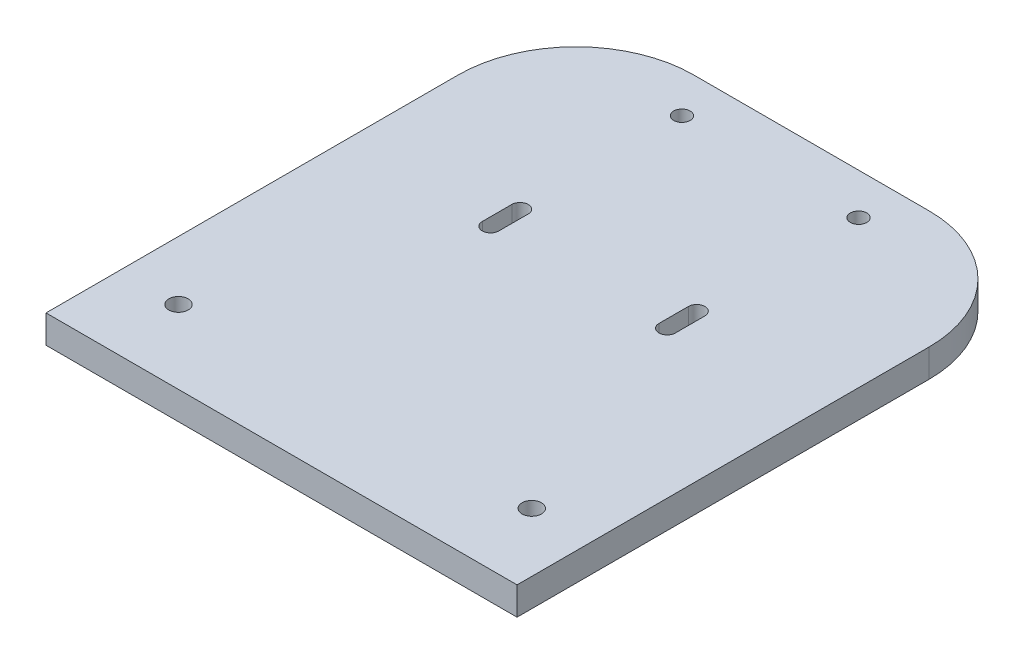
ISO-10303-21;
HEADER;
FILE_DESCRIPTION(('STEP AP214'),'2;1');
FILE_NAME('part.step','',(''),(''),'','','');
FILE_SCHEMA(('AUTOMOTIVE_DESIGN { 1 0 10303 214 1 1 1 1 }'));
ENDSEC;
DATA;
#1=APPLICATION_CONTEXT('core data for automotive mechanical design processes');
#2=APPLICATION_PROTOCOL_DEFINITION('international standard','automotive_design',2000,#1);
#3=PRODUCT_CONTEXT('',#1,'mechanical');
#4=PRODUCT('Part','Part','',(#3));
#5=PRODUCT_RELATED_PRODUCT_CATEGORY('part','',(#4));
#6=PRODUCT_DEFINITION_FORMATION('','',#4);
#7=PRODUCT_DEFINITION_CONTEXT('part definition',#1,'design');
#8=PRODUCT_DEFINITION('design','',#6,#7);
#9=PRODUCT_DEFINITION_SHAPE('','',#8);
#10=(LENGTH_UNIT() NAMED_UNIT(*) SI_UNIT(.MILLI.,.METRE.));
#11=(NAMED_UNIT(*) PLANE_ANGLE_UNIT() SI_UNIT($,.RADIAN.));
#12=(NAMED_UNIT(*) SI_UNIT($,.STERADIAN.) SOLID_ANGLE_UNIT());
#13=UNCERTAINTY_MEASURE_WITH_UNIT(LENGTH_MEASURE(1.E-05),#10,'distance_accuracy_value','');
#14=(GEOMETRIC_REPRESENTATION_CONTEXT(3) GLOBAL_UNCERTAINTY_ASSIGNED_CONTEXT((#13)) GLOBAL_UNIT_ASSIGNED_CONTEXT((#10,
#11,#12)) REPRESENTATION_CONTEXT('',''));
#15=CARTESIAN_POINT('',(0.,0.,0.));
#16=DIRECTION('',(0.,0.,1.));
#17=DIRECTION('',(1.,0.,0.));
#18=AXIS2_PLACEMENT_3D('',#15,#16,#17);
#19=CARTESIAN_POINT('',(0.,4.76,0.));
#20=DIRECTION('',(1.,0.,0.));
#21=DIRECTION('',(0.,0.,-1.));
#22=AXIS2_PLACEMENT_3D('',#19,#20,#21);
#23=PLANE('',#22);
#24=DIRECTION('',(0.,0.,1.));
#25=VECTOR('',#24,1.);
#26=CARTESIAN_POINT('',(0.,4.76,0.));
#27=LINE('',#26,#25);
#28=CARTESIAN_POINT('',(0.,4.76,-70.));
#29=VERTEX_POINT('',#28);
#30=CARTESIAN_POINT('',(0.,4.76,0.));
#31=VERTEX_POINT('',#30);
#32=EDGE_CURVE('E233',#29,#31,#27,.T.);
#33=ORIENTED_EDGE('',*,*,#32,.F.);
#34=DIRECTION('',(0.,-1.,0.));
#35=VECTOR('',#34,1.);
#36=CARTESIAN_POINT('',(0.,4.76,-70.));
#37=LINE('',#36,#35);
#38=CARTESIAN_POINT('',(0.,0.,-70.));
#39=VERTEX_POINT('',#38);
#40=EDGE_CURVE('E11',#29,#39,#37,.T.);
#41=ORIENTED_EDGE('',*,*,#40,.T.);
#42=DIRECTION('',(0.,0.,1.));
#43=VECTOR('',#42,1.);
#44=CARTESIAN_POINT('',(0.,0.,0.));
#45=LINE('',#44,#43);
#46=CARTESIAN_POINT('',(0.,0.,0.));
#47=VERTEX_POINT('',#46);
#48=EDGE_CURVE('E243',#39,#47,#45,.T.);
#49=ORIENTED_EDGE('',*,*,#48,.T.);
#50=DIRECTION('',(0.,-1.,0.));
#51=VECTOR('',#50,1.);
#52=CARTESIAN_POINT('',(0.,4.76,0.));
#53=LINE('',#52,#51);
#54=EDGE_CURVE('E254',#31,#47,#53,.T.);
#55=ORIENTED_EDGE('',*,*,#54,.F.);
#56=EDGE_LOOP('',(#33,#41,#49,#55));
#57=FACE_BOUND('',#56,.T.);
#58=ADVANCED_FACE('F39',(#57),#23,.F.);
#59=CARTESIAN_POINT('',(0.,4.76,0.));
#60=DIRECTION('',(0.,0.,-1.));
#61=DIRECTION('',(-1.,0.,0.));
#62=AXIS2_PLACEMENT_3D('',#59,#60,#61);
#63=PLANE('',#62);
#64=DIRECTION('',(1.,0.,0.));
#65=VECTOR('',#64,1.);
#66=CARTESIAN_POINT('',(0.,0.,0.));
#67=LINE('',#66,#65);
#68=CARTESIAN_POINT('',(80.,0.,0.));
#69=VERTEX_POINT('',#68);
#70=EDGE_CURVE('E245',#47,#69,#67,.T.);
#71=ORIENTED_EDGE('',*,*,#70,.T.);
#72=DIRECTION('',(0.,-1.,0.));
#73=VECTOR('',#72,1.);
#74=CARTESIAN_POINT('',(80.,4.76,0.));
#75=LINE('',#74,#73);
#76=CARTESIAN_POINT('',(80.,4.76,0.));
#77=VERTEX_POINT('',#76);
#78=EDGE_CURVE('E242',#77,#69,#75,.T.);
#79=ORIENTED_EDGE('',*,*,#78,.F.);
#80=DIRECTION('',(1.,0.,0.));
#81=VECTOR('',#80,1.);
#82=CARTESIAN_POINT('',(0.,4.76,0.));
#83=LINE('',#82,#81);
#84=EDGE_CURVE('E235',#31,#77,#83,.T.);
#85=ORIENTED_EDGE('',*,*,#84,.F.);
#86=ORIENTED_EDGE('',*,*,#54,.T.);
#87=EDGE_LOOP('',(#71,#79,#85,#86));
#88=FACE_BOUND('',#87,.T.);
#89=ADVANCED_FACE('F284',(#88),#63,.F.);
#90=CARTESIAN_POINT('',(80.,4.76,0.));
#91=DIRECTION('',(-1.,0.,0.));
#92=DIRECTION('',(0.,0.,1.));
#93=AXIS2_PLACEMENT_3D('',#90,#91,#92);
#94=PLANE('',#93);
#95=DIRECTION('',(0.,0.,-1.));
#96=VECTOR('',#95,1.);
#97=CARTESIAN_POINT('',(80.,0.,0.));
#98=LINE('',#97,#96);
#99=CARTESIAN_POINT('',(80.,0.,-70.));
#100=VERTEX_POINT('',#99);
#101=EDGE_CURVE('E248',#69,#100,#98,.T.);
#102=ORIENTED_EDGE('',*,*,#101,.T.);
#103=DIRECTION('',(0.,-1.,0.));
#104=VECTOR('',#103,1.);
#105=CARTESIAN_POINT('',(80.,4.76,-70.));
#106=LINE('',#105,#104);
#107=CARTESIAN_POINT('',(80.,4.76,-70.));
#108=VERTEX_POINT('',#107);
#109=EDGE_CURVE('E62',#100,#108,#106,.F.);
#110=ORIENTED_EDGE('',*,*,#109,.T.);
#111=DIRECTION('',(0.,0.,-1.));
#112=VECTOR('',#111,1.);
#113=CARTESIAN_POINT('',(80.,4.76,0.));
#114=LINE('',#113,#112);
#115=EDGE_CURVE('E238',#77,#108,#114,.T.);
#116=ORIENTED_EDGE('',*,*,#115,.F.);
#117=ORIENTED_EDGE('',*,*,#78,.T.);
#118=EDGE_LOOP('',(#102,#110,#116,#117));
#119=FACE_BOUND('',#118,.T.);
#120=ADVANCED_FACE('F280',(#119),#94,.F.);
#121=CARTESIAN_POINT('',(0.,4.76,-90.));
#122=DIRECTION('',(0.,0.,1.));
#123=DIRECTION('',(1.,0.,0.));
#124=AXIS2_PLACEMENT_3D('',#121,#122,#123);
#125=PLANE('',#124);
#126=DIRECTION('',(-1.,0.,0.));
#127=VECTOR('',#126,1.);
#128=CARTESIAN_POINT('',(0.,4.76,-90.));
#129=LINE('',#128,#127);
#130=CARTESIAN_POINT('',(60.,4.76,-90.));
#131=VERTEX_POINT('',#130);
#132=CARTESIAN_POINT('',(20.,4.76,-90.));
#133=VERTEX_POINT('',#132);
#134=EDGE_CURVE('E240',#131,#133,#129,.T.);
#135=ORIENTED_EDGE('',*,*,#134,.F.);
#136=DIRECTION('',(0.,-1.,0.));
#137=VECTOR('',#136,1.);
#138=CARTESIAN_POINT('',(60.,4.76,-90.));
#139=LINE('',#138,#137);
#140=CARTESIAN_POINT('',(60.,0.,-90.));
#141=VERTEX_POINT('',#140);
#142=EDGE_CURVE('E259',#131,#141,#139,.T.);
#143=ORIENTED_EDGE('',*,*,#142,.T.);
#144=DIRECTION('',(-1.,0.,0.));
#145=VECTOR('',#144,1.);
#146=CARTESIAN_POINT('',(0.,0.,-90.));
#147=LINE('',#146,#145);
#148=CARTESIAN_POINT('',(20.,0.,-90.));
#149=VERTEX_POINT('',#148);
#150=EDGE_CURVE('E236',#141,#149,#147,.T.);
#151=ORIENTED_EDGE('',*,*,#150,.T.);
#152=DIRECTION('',(0.,-1.,0.));
#153=VECTOR('',#152,1.);
#154=CARTESIAN_POINT('',(20.,4.76,-90.));
#155=LINE('',#154,#153);
#156=EDGE_CURVE('E257',#149,#133,#155,.F.);
#157=ORIENTED_EDGE('',*,*,#156,.T.);
#158=EDGE_LOOP('',(#135,#143,#151,#157));
#159=FACE_BOUND('',#158,.T.);
#160=ADVANCED_FACE('F272',(#159),#125,.F.);
#161=CARTESIAN_POINT('',(0.,4.76,0.));
#162=DIRECTION('',(0.,-1.,0.));
#163=DIRECTION('',(0.,0.,-1.));
#164=AXIS2_PLACEMENT_3D('',#161,#162,#163);
#165=PLANE('',#164);
#166=CARTESIAN_POINT('',(10.,4.76,-12.5));
#167=DIRECTION('',(0.,1.,0.));
#168=DIRECTION('',(0.,0.,1.));
#169=AXIS2_PLACEMENT_3D('',#166,#167,#168);
#170=CIRCLE('',#169,1.65);
#171=CARTESIAN_POINT('',(10.,4.76,-10.85));
#172=VERTEX_POINT('',#171);
#173=EDGE_CURVE('E224',#172,#172,#170,.T.);
#174=ORIENTED_EDGE('',*,*,#173,.F.);
#175=EDGE_LOOP('',(#174));
#176=FACE_BOUND('',#175,.T.);
#177=DIRECTION('',(0.,0.,1.));
#178=VECTOR('',#177,1.);
#179=CARTESIAN_POINT('',(53.6,4.76,-55.5));
#180=LINE('',#179,#178);
#181=CARTESIAN_POINT('',(53.6,4.76,-55.5));
#182=VERTEX_POINT('',#181);
#183=CARTESIAN_POINT('',(53.6,4.76,-50.5));
#184=VERTEX_POINT('',#183);
#185=EDGE_CURVE('E167',#182,#184,#180,.T.);
#186=ORIENTED_EDGE('',*,*,#185,.F.);
#187=CARTESIAN_POINT('',(55.,4.76,-55.5));
#188=DIRECTION('',(0.,1.,0.));
#189=DIRECTION('',(0.,0.,-1.));
#190=AXIS2_PLACEMENT_3D('',#187,#188,#189);
#191=CIRCLE('',#190,1.4);
#192=CARTESIAN_POINT('',(56.4,4.76,-55.5));
#193=VERTEX_POINT('',#192);
#194=EDGE_CURVE('E146',#193,#182,#191,.T.);
#195=ORIENTED_EDGE('',*,*,#194,.F.);
#196=DIRECTION('',(0.,0.,-1.));
#197=VECTOR('',#196,1.);
#198=CARTESIAN_POINT('',(56.4,4.76,-55.5));
#199=LINE('',#198,#197);
#200=CARTESIAN_POINT('',(56.4,4.76,-50.5));
#201=VERTEX_POINT('',#200);
#202=EDGE_CURVE('E156',#201,#193,#199,.T.);
#203=ORIENTED_EDGE('',*,*,#202,.F.);
#204=CARTESIAN_POINT('',(55.,4.76,-50.5));
#205=DIRECTION('',(0.,1.,0.));
#206=DIRECTION('',(0.,0.,-1.));
#207=AXIS2_PLACEMENT_3D('',#204,#205,#206);
#208=CIRCLE('',#207,1.4);
#209=EDGE_CURVE('E161',#184,#201,#208,.T.);
#210=ORIENTED_EDGE('',*,*,#209,.F.);
#211=EDGE_LOOP('',(#186,#195,#203,#210));
#212=FACE_BOUND('',#211,.T.);
#213=CARTESIAN_POINT('',(70.,4.76,-12.5));
#214=DIRECTION('',(0.,1.,0.));
#215=DIRECTION('',(0.,0.,-1.));
#216=AXIS2_PLACEMENT_3D('',#213,#214,#215);
#217=CIRCLE('',#216,1.65);
#218=CARTESIAN_POINT('',(70.,4.76,-14.15));
#219=VERTEX_POINT('',#218);
#220=EDGE_CURVE('E221',#219,#219,#217,.T.);
#221=ORIENTED_EDGE('',*,*,#220,.F.);
#222=EDGE_LOOP('',(#221));
#223=FACE_BOUND('',#222,.T.);
#224=CARTESIAN_POINT('',(25.,4.76,-83.));
#225=DIRECTION('',(0.,1.,0.));
#226=DIRECTION('',(0.,0.,1.));
#227=AXIS2_PLACEMENT_3D('',#224,#225,#226);
#228=CIRCLE('',#227,1.4);
#229=CARTESIAN_POINT('',(25.,4.76,-81.6));
#230=VERTEX_POINT('',#229);
#231=EDGE_CURVE('E228',#230,#230,#228,.T.);
#232=ORIENTED_EDGE('',*,*,#231,.F.);
#233=EDGE_LOOP('',(#232));
#234=FACE_BOUND('',#233,.T.);
#235=CARTESIAN_POINT('',(55.,4.76,-83.));
#236=DIRECTION('',(0.,1.,0.));
#237=DIRECTION('',(0.,0.,-1.));
#238=AXIS2_PLACEMENT_3D('',#235,#236,#237);
#239=CIRCLE('',#238,1.4);
#240=CARTESIAN_POINT('',(55.,4.76,-84.4));
#241=VERTEX_POINT('',#240);
#242=EDGE_CURVE('E185',#241,#241,#239,.T.);
#243=ORIENTED_EDGE('',*,*,#242,.F.);
#244=EDGE_LOOP('',(#243));
#245=FACE_BOUND('',#244,.T.);
#246=DIRECTION('',(0.,0.,1.));
#247=VECTOR('',#246,1.);
#248=CARTESIAN_POINT('',(23.6,4.76,-55.5));
#249=LINE('',#248,#247);
#250=CARTESIAN_POINT('',(23.6,4.76,-55.5));
#251=VERTEX_POINT('',#250);
#252=CARTESIAN_POINT('',(23.6,4.76,-50.5));
#253=VERTEX_POINT('',#252);
#254=EDGE_CURVE('E207',#251,#253,#249,.T.);
#255=ORIENTED_EDGE('',*,*,#254,.F.);
#256=CARTESIAN_POINT('',(25.,4.76,-55.5));
#257=DIRECTION('',(0.,1.,0.));
#258=DIRECTION('',(0.,0.,1.));
#259=AXIS2_PLACEMENT_3D('',#256,#257,#258);
#260=CIRCLE('',#259,1.4);
#261=CARTESIAN_POINT('',(26.4,4.76,-55.5));
#262=VERTEX_POINT('',#261);
#263=EDGE_CURVE('E192',#262,#251,#260,.T.);
#264=ORIENTED_EDGE('',*,*,#263,.F.);
#265=DIRECTION('',(0.,0.,-1.));
#266=VECTOR('',#265,1.);
#267=CARTESIAN_POINT('',(26.4,4.76,-55.5));
#268=LINE('',#267,#266);
#269=CARTESIAN_POINT('',(26.4,4.76,-50.5));
#270=VERTEX_POINT('',#269);
#271=EDGE_CURVE('E200',#270,#262,#268,.T.);
#272=ORIENTED_EDGE('',*,*,#271,.F.);
#273=CARTESIAN_POINT('',(25.,4.76,-50.5));
#274=DIRECTION('',(0.,1.,0.));
#275=DIRECTION('',(0.,0.,1.));
#276=AXIS2_PLACEMENT_3D('',#273,#274,#275);
#277=CIRCLE('',#276,1.4);
#278=EDGE_CURVE('E203',#253,#270,#277,.T.);
#279=ORIENTED_EDGE('',*,*,#278,.F.);
#280=EDGE_LOOP('',(#255,#264,#272,#279));
#281=FACE_BOUND('',#280,.T.);
#282=ORIENTED_EDGE('',*,*,#115,.T.);
#283=CARTESIAN_POINT('',(60.,4.76,-70.));
#284=DIRECTION('',(0.,-1.,0.));
#285=DIRECTION('',(0.,0.,-1.));
#286=AXIS2_PLACEMENT_3D('',#283,#284,#285);
#287=CIRCLE('',#286,20.);
#288=EDGE_CURVE('E47',#108,#131,#287,.F.);
#289=ORIENTED_EDGE('',*,*,#288,.T.);
#290=ORIENTED_EDGE('',*,*,#134,.T.);
#291=CARTESIAN_POINT('',(20.,4.76,-70.));
#292=DIRECTION('',(0.,-1.,0.));
#293=DIRECTION('',(0.,0.,-1.));
#294=AXIS2_PLACEMENT_3D('',#291,#292,#293);
#295=CIRCLE('',#294,20.);
#296=EDGE_CURVE('E54',#133,#29,#295,.F.);
#297=ORIENTED_EDGE('',*,*,#296,.T.);
#298=ORIENTED_EDGE('',*,*,#32,.T.);
#299=ORIENTED_EDGE('',*,*,#84,.T.);
#300=EDGE_LOOP('',(#282,#289,#290,#297,#298,#299));
#301=FACE_BOUND('',#300,.T.);
#302=ADVANCED_FACE('F164',(#176,#212,#223,#234,#245,#281,#301),#165,.F.);
#303=CARTESIAN_POINT('',(0.,0.,0.));
#304=DIRECTION('',(0.,-1.,0.));
#305=DIRECTION('',(0.,0.,-1.));
#306=AXIS2_PLACEMENT_3D('',#303,#304,#305);
#307=PLANE('',#306);
#308=CARTESIAN_POINT('',(10.,0.,-12.5));
#309=DIRECTION('',(0.,1.,0.));
#310=DIRECTION('',(0.,0.,1.));
#311=AXIS2_PLACEMENT_3D('',#308,#309,#310);
#312=CIRCLE('',#311,1.65);
#313=CARTESIAN_POINT('',(10.,0.,-10.85));
#314=VERTEX_POINT('',#313);
#315=EDGE_CURVE('E246',#314,#314,#312,.T.);
#316=ORIENTED_EDGE('',*,*,#315,.T.);
#317=EDGE_LOOP('',(#316));
#318=FACE_BOUND('',#317,.T.);
#319=CARTESIAN_POINT('',(55.,0.,-55.5));
#320=DIRECTION('',(0.,1.,0.));
#321=DIRECTION('',(0.,0.,-1.));
#322=AXIS2_PLACEMENT_3D('',#319,#320,#321);
#323=CIRCLE('',#322,1.4);
#324=CARTESIAN_POINT('',(56.4,0.,-55.5));
#325=VERTEX_POINT('',#324);
#326=CARTESIAN_POINT('',(53.6,0.,-55.5));
#327=VERTEX_POINT('',#326);
#328=EDGE_CURVE('E149',#325,#327,#323,.T.);
#329=ORIENTED_EDGE('',*,*,#328,.T.);
#330=DIRECTION('',(0.,0.,1.));
#331=VECTOR('',#330,1.);
#332=CARTESIAN_POINT('',(53.6,0.,-55.5));
#333=LINE('',#332,#331);
#334=CARTESIAN_POINT('',(53.6,0.,-50.5));
#335=VERTEX_POINT('',#334);
#336=EDGE_CURVE('E181',#327,#335,#333,.T.);
#337=ORIENTED_EDGE('',*,*,#336,.T.);
#338=CARTESIAN_POINT('',(55.,0.,-50.5));
#339=DIRECTION('',(0.,1.,0.));
#340=DIRECTION('',(0.,0.,-1.));
#341=AXIS2_PLACEMENT_3D('',#338,#339,#340);
#342=CIRCLE('',#341,1.4);
#343=CARTESIAN_POINT('',(56.4,0.,-50.5));
#344=VERTEX_POINT('',#343);
#345=EDGE_CURVE('E177',#335,#344,#342,.T.);
#346=ORIENTED_EDGE('',*,*,#345,.T.);
#347=DIRECTION('',(0.,0.,-1.));
#348=VECTOR('',#347,1.);
#349=CARTESIAN_POINT('',(56.4,0.,-55.5));
#350=LINE('',#349,#348);
#351=EDGE_CURVE('E175',#344,#325,#350,.T.);
#352=ORIENTED_EDGE('',*,*,#351,.T.);
#353=EDGE_LOOP('',(#329,#337,#346,#352));
#354=FACE_BOUND('',#353,.T.);
#355=CARTESIAN_POINT('',(70.,0.,-12.5));
#356=DIRECTION('',(0.,1.,0.));
#357=DIRECTION('',(0.,0.,-1.));
#358=AXIS2_PLACEMENT_3D('',#355,#356,#357);
#359=CIRCLE('',#358,1.65);
#360=CARTESIAN_POINT('',(70.,0.,-14.15));
#361=VERTEX_POINT('',#360);
#362=EDGE_CURVE('E225',#361,#361,#359,.T.);
#363=ORIENTED_EDGE('',*,*,#362,.T.);
#364=EDGE_LOOP('',(#363));
#365=FACE_BOUND('',#364,.T.);
#366=CARTESIAN_POINT('',(25.,0.,-83.));
#367=DIRECTION('',(0.,1.,0.));
#368=DIRECTION('',(0.,0.,1.));
#369=AXIS2_PLACEMENT_3D('',#366,#367,#368);
#370=CIRCLE('',#369,1.4);
#371=CARTESIAN_POINT('',(25.,0.,-81.6));
#372=VERTEX_POINT('',#371);
#373=EDGE_CURVE('E188',#372,#372,#370,.T.);
#374=ORIENTED_EDGE('',*,*,#373,.T.);
#375=EDGE_LOOP('',(#374));
#376=FACE_BOUND('',#375,.T.);
#377=CARTESIAN_POINT('',(55.,0.,-83.));
#378=DIRECTION('',(0.,1.,0.));
#379=DIRECTION('',(0.,0.,-1.));
#380=AXIS2_PLACEMENT_3D('',#377,#378,#379);
#381=CIRCLE('',#380,1.4);
#382=CARTESIAN_POINT('',(55.,0.,-84.4));
#383=VERTEX_POINT('',#382);
#384=EDGE_CURVE('E189',#383,#383,#381,.T.);
#385=ORIENTED_EDGE('',*,*,#384,.T.);
#386=EDGE_LOOP('',(#385));
#387=FACE_BOUND('',#386,.T.);
#388=CARTESIAN_POINT('',(25.,0.,-55.5));
#389=DIRECTION('',(0.,1.,0.));
#390=DIRECTION('',(0.,0.,1.));
#391=AXIS2_PLACEMENT_3D('',#388,#389,#390);
#392=CIRCLE('',#391,1.4);
#393=CARTESIAN_POINT('',(26.4,0.,-55.5));
#394=VERTEX_POINT('',#393);
#395=CARTESIAN_POINT('',(23.6,0.,-55.5));
#396=VERTEX_POINT('',#395);
#397=EDGE_CURVE('E204',#394,#396,#392,.T.);
#398=ORIENTED_EDGE('',*,*,#397,.T.);
#399=DIRECTION('',(0.,0.,1.));
#400=VECTOR('',#399,1.);
#401=CARTESIAN_POINT('',(23.6,0.,-55.5));
#402=LINE('',#401,#400);
#403=CARTESIAN_POINT('',(23.6,0.,-50.5));
#404=VERTEX_POINT('',#403);
#405=EDGE_CURVE('E216',#396,#404,#402,.T.);
#406=ORIENTED_EDGE('',*,*,#405,.T.);
#407=CARTESIAN_POINT('',(25.,0.,-50.5));
#408=DIRECTION('',(0.,1.,0.));
#409=DIRECTION('',(0.,0.,1.));
#410=AXIS2_PLACEMENT_3D('',#407,#408,#409);
#411=CIRCLE('',#410,1.4);
#412=CARTESIAN_POINT('',(26.4,0.,-50.5));
#413=VERTEX_POINT('',#412);
#414=EDGE_CURVE('E213',#404,#413,#411,.T.);
#415=ORIENTED_EDGE('',*,*,#414,.T.);
#416=DIRECTION('',(0.,0.,-1.));
#417=VECTOR('',#416,1.);
#418=CARTESIAN_POINT('',(26.4,0.,-55.5));
#419=LINE('',#418,#417);
#420=EDGE_CURVE('E196',#413,#394,#419,.T.);
#421=ORIENTED_EDGE('',*,*,#420,.T.);
#422=EDGE_LOOP('',(#398,#406,#415,#421));
#423=FACE_BOUND('',#422,.T.);
#424=ORIENTED_EDGE('',*,*,#150,.F.);
#425=CARTESIAN_POINT('',(60.,0.,-70.));
#426=DIRECTION('',(0.,-1.,0.));
#427=DIRECTION('',(0.,0.,-1.));
#428=AXIS2_PLACEMENT_3D('',#425,#426,#427);
#429=CIRCLE('',#428,20.);
#430=EDGE_CURVE('E264',#141,#100,#429,.T.);
#431=ORIENTED_EDGE('',*,*,#430,.T.);
#432=ORIENTED_EDGE('',*,*,#101,.F.);
#433=ORIENTED_EDGE('',*,*,#70,.F.);
#434=ORIENTED_EDGE('',*,*,#48,.F.);
#435=CARTESIAN_POINT('',(20.,0.,-70.));
#436=DIRECTION('',(0.,-1.,0.));
#437=DIRECTION('',(0.,0.,-1.));
#438=AXIS2_PLACEMENT_3D('',#435,#436,#437);
#439=CIRCLE('',#438,20.);
#440=EDGE_CURVE('E262',#39,#149,#439,.T.);
#441=ORIENTED_EDGE('',*,*,#440,.T.);
#442=EDGE_LOOP('',(#424,#431,#432,#433,#434,#441));
#443=FACE_BOUND('',#442,.T.);
#444=ADVANCED_FACE('F278',(#318,#354,#365,#376,#387,#423,#443),#307,.T.);
#445=CARTESIAN_POINT('',(25.,0.,-55.5));
#446=DIRECTION('',(0.,1.,0.));
#447=DIRECTION('',(0.,0.,1.));
#448=AXIS2_PLACEMENT_3D('',#445,#446,#447);
#449=CYLINDRICAL_SURFACE('',#448,1.4);
#450=ORIENTED_EDGE('',*,*,#263,.T.);
#451=DIRECTION('',(0.,1.,0.));
#452=VECTOR('',#451,1.);
#453=CARTESIAN_POINT('',(23.6,0.,-55.5));
#454=LINE('',#453,#452);
#455=EDGE_CURVE('E193',#396,#251,#454,.T.);
#456=ORIENTED_EDGE('',*,*,#455,.F.);
#457=ORIENTED_EDGE('',*,*,#397,.F.);
#458=DIRECTION('',(0.,1.,0.));
#459=VECTOR('',#458,1.);
#460=CARTESIAN_POINT('',(26.4,0.,-55.5));
#461=LINE('',#460,#459);
#462=EDGE_CURVE('E168',#394,#262,#461,.T.);
#463=ORIENTED_EDGE('',*,*,#462,.T.);
#464=EDGE_LOOP('',(#450,#456,#457,#463));
#465=FACE_BOUND('',#464,.T.);
#466=ADVANCED_FACE('F309',(#465),#449,.F.);
#467=CARTESIAN_POINT('',(26.4,0.,-55.5));
#468=DIRECTION('',(1.,0.,0.));
#469=DIRECTION('',(0.,0.,-1.));
#470=AXIS2_PLACEMENT_3D('',#467,#468,#469);
#471=PLANE('',#470);
#472=ORIENTED_EDGE('',*,*,#271,.T.);
#473=ORIENTED_EDGE('',*,*,#462,.F.);
#474=ORIENTED_EDGE('',*,*,#420,.F.);
#475=DIRECTION('',(0.,1.,0.));
#476=VECTOR('',#475,1.);
#477=CARTESIAN_POINT('',(26.4,0.,-50.5));
#478=LINE('',#477,#476);
#479=EDGE_CURVE('E170',#413,#270,#478,.T.);
#480=ORIENTED_EDGE('',*,*,#479,.T.);
#481=EDGE_LOOP('',(#472,#473,#474,#480));
#482=FACE_BOUND('',#481,.T.);
#483=ADVANCED_FACE('F323',(#482),#471,.F.);
#484=CARTESIAN_POINT('',(25.,0.,-50.5));
#485=DIRECTION('',(0.,1.,0.));
#486=DIRECTION('',(0.,0.,1.));
#487=AXIS2_PLACEMENT_3D('',#484,#485,#486);
#488=CYLINDRICAL_SURFACE('',#487,1.4);
#489=ORIENTED_EDGE('',*,*,#278,.T.);
#490=ORIENTED_EDGE('',*,*,#479,.F.);
#491=ORIENTED_EDGE('',*,*,#414,.F.);
#492=DIRECTION('',(0.,1.,0.));
#493=VECTOR('',#492,1.);
#494=CARTESIAN_POINT('',(23.6,0.,-50.5));
#495=LINE('',#494,#493);
#496=EDGE_CURVE('E197',#404,#253,#495,.T.);
#497=ORIENTED_EDGE('',*,*,#496,.T.);
#498=EDGE_LOOP('',(#489,#490,#491,#497));
#499=FACE_BOUND('',#498,.T.);
#500=ADVANCED_FACE('F326',(#499),#488,.F.);
#501=CARTESIAN_POINT('',(23.6,0.,-55.5));
#502=DIRECTION('',(-1.,0.,0.));
#503=DIRECTION('',(0.,0.,1.));
#504=AXIS2_PLACEMENT_3D('',#501,#502,#503);
#505=PLANE('',#504);
#506=ORIENTED_EDGE('',*,*,#254,.T.);
#507=ORIENTED_EDGE('',*,*,#496,.F.);
#508=ORIENTED_EDGE('',*,*,#405,.F.);
#509=ORIENTED_EDGE('',*,*,#455,.T.);
#510=EDGE_LOOP('',(#506,#507,#508,#509));
#511=FACE_BOUND('',#510,.T.);
#512=ADVANCED_FACE('F330',(#511),#505,.F.);
#513=CARTESIAN_POINT('',(55.,0.,-83.));
#514=DIRECTION('',(0.,1.,0.));
#515=DIRECTION('',(0.,0.,1.));
#516=AXIS2_PLACEMENT_3D('',#513,#514,#515);
#517=CYLINDRICAL_SURFACE('',#516,1.4);
#518=ORIENTED_EDGE('',*,*,#384,.F.);
#519=EDGE_LOOP('',(#518));
#520=FACE_BOUND('',#519,.T.);
#521=ORIENTED_EDGE('',*,*,#242,.T.);
#522=EDGE_LOOP('',(#521));
#523=FACE_BOUND('',#522,.T.);
#524=ADVANCED_FACE('F318',(#520,#523),#517,.F.);
#525=CARTESIAN_POINT('',(25.,0.,-83.));
#526=DIRECTION('',(0.,1.,0.));
#527=DIRECTION('',(0.,0.,1.));
#528=AXIS2_PLACEMENT_3D('',#525,#526,#527);
#529=CYLINDRICAL_SURFACE('',#528,1.4);
#530=ORIENTED_EDGE('',*,*,#373,.F.);
#531=EDGE_LOOP('',(#530));
#532=FACE_BOUND('',#531,.T.);
#533=ORIENTED_EDGE('',*,*,#231,.T.);
#534=EDGE_LOOP('',(#533));
#535=FACE_BOUND('',#534,.T.);
#536=ADVANCED_FACE('F314',(#532,#535),#529,.F.);
#537=CARTESIAN_POINT('',(70.,0.,-12.5));
#538=DIRECTION('',(0.,1.,0.));
#539=DIRECTION('',(0.,0.,1.));
#540=AXIS2_PLACEMENT_3D('',#537,#538,#539);
#541=CYLINDRICAL_SURFACE('',#540,1.65);
#542=ORIENTED_EDGE('',*,*,#362,.F.);
#543=EDGE_LOOP('',(#542));
#544=FACE_BOUND('',#543,.T.);
#545=ORIENTED_EDGE('',*,*,#220,.T.);
#546=EDGE_LOOP('',(#545));
#547=FACE_BOUND('',#546,.T.);
#548=ADVANCED_FACE('F317',(#544,#547),#541,.F.);
#549=CARTESIAN_POINT('',(55.,0.,-55.5));
#550=DIRECTION('',(0.,1.,0.));
#551=DIRECTION('',(0.,0.,1.));
#552=AXIS2_PLACEMENT_3D('',#549,#550,#551);
#553=CYLINDRICAL_SURFACE('',#552,1.4);
#554=ORIENTED_EDGE('',*,*,#194,.T.);
#555=DIRECTION('',(0.,1.,0.));
#556=VECTOR('',#555,1.);
#557=CARTESIAN_POINT('',(53.6,0.,-55.5));
#558=LINE('',#557,#556);
#559=EDGE_CURVE('E178',#327,#182,#558,.T.);
#560=ORIENTED_EDGE('',*,*,#559,.F.);
#561=ORIENTED_EDGE('',*,*,#328,.F.);
#562=DIRECTION('',(0.,1.,0.));
#563=VECTOR('',#562,1.);
#564=CARTESIAN_POINT('',(56.4,0.,-55.5));
#565=LINE('',#564,#563);
#566=EDGE_CURVE('E142',#325,#193,#565,.T.);
#567=ORIENTED_EDGE('',*,*,#566,.T.);
#568=EDGE_LOOP('',(#554,#560,#561,#567));
#569=FACE_BOUND('',#568,.T.);
#570=ADVANCED_FACE('F144',(#569),#553,.F.);
#571=CARTESIAN_POINT('',(56.4,0.,-55.5));
#572=DIRECTION('',(1.,0.,0.));
#573=DIRECTION('',(0.,0.,-1.));
#574=AXIS2_PLACEMENT_3D('',#571,#572,#573);
#575=PLANE('',#574);
#576=ORIENTED_EDGE('',*,*,#202,.T.);
#577=ORIENTED_EDGE('',*,*,#566,.F.);
#578=ORIENTED_EDGE('',*,*,#351,.F.);
#579=DIRECTION('',(0.,1.,0.));
#580=VECTOR('',#579,1.);
#581=CARTESIAN_POINT('',(56.4,0.,-50.5));
#582=LINE('',#581,#580);
#583=EDGE_CURVE('E153',#344,#201,#582,.T.);
#584=ORIENTED_EDGE('',*,*,#583,.T.);
#585=EDGE_LOOP('',(#576,#577,#578,#584));
#586=FACE_BOUND('',#585,.T.);
#587=ADVANCED_FACE('F157',(#586),#575,.F.);
#588=CARTESIAN_POINT('',(55.,0.,-50.5));
#589=DIRECTION('',(0.,1.,0.));
#590=DIRECTION('',(0.,0.,1.));
#591=AXIS2_PLACEMENT_3D('',#588,#589,#590);
#592=CYLINDRICAL_SURFACE('',#591,1.4);
#593=ORIENTED_EDGE('',*,*,#209,.T.);
#594=ORIENTED_EDGE('',*,*,#583,.F.);
#595=ORIENTED_EDGE('',*,*,#345,.F.);
#596=DIRECTION('',(0.,1.,0.));
#597=VECTOR('',#596,1.);
#598=CARTESIAN_POINT('',(53.6,0.,-50.5));
#599=LINE('',#598,#597);
#600=EDGE_CURVE('E365',#335,#184,#599,.T.);
#601=ORIENTED_EDGE('',*,*,#600,.T.);
#602=EDGE_LOOP('',(#593,#594,#595,#601));
#603=FACE_BOUND('',#602,.T.);
#604=ADVANCED_FACE('F343',(#603),#592,.F.);
#605=CARTESIAN_POINT('',(53.6,0.,-55.5));
#606=DIRECTION('',(-1.,0.,0.));
#607=DIRECTION('',(0.,0.,1.));
#608=AXIS2_PLACEMENT_3D('',#605,#606,#607);
#609=PLANE('',#608);
#610=ORIENTED_EDGE('',*,*,#185,.T.);
#611=ORIENTED_EDGE('',*,*,#600,.F.);
#612=ORIENTED_EDGE('',*,*,#336,.F.);
#613=ORIENTED_EDGE('',*,*,#559,.T.);
#614=EDGE_LOOP('',(#610,#611,#612,#613));
#615=FACE_BOUND('',#614,.T.);
#616=ADVANCED_FACE('F346',(#615),#609,.F.);
#617=CARTESIAN_POINT('',(10.,0.,-12.5));
#618=DIRECTION('',(0.,1.,0.));
#619=DIRECTION('',(0.,0.,1.));
#620=AXIS2_PLACEMENT_3D('',#617,#618,#619);
#621=CYLINDRICAL_SURFACE('',#620,1.65);
#622=ORIENTED_EDGE('',*,*,#315,.F.);
#623=EDGE_LOOP('',(#622));
#624=FACE_BOUND('',#623,.T.);
#625=ORIENTED_EDGE('',*,*,#173,.T.);
#626=EDGE_LOOP('',(#625));
#627=FACE_BOUND('',#626,.T.);
#628=ADVANCED_FACE('F294',(#624,#627),#621,.F.);
#629=CARTESIAN_POINT('',(60.,4.76,-70.));
#630=DIRECTION('',(0.,-1.,0.));
#631=DIRECTION('',(0.,0.,-1.));
#632=AXIS2_PLACEMENT_3D('',#629,#630,#631);
#633=CYLINDRICAL_SURFACE('',#632,20.);
#634=ORIENTED_EDGE('',*,*,#288,.F.);
#635=ORIENTED_EDGE('',*,*,#109,.F.);
#636=ORIENTED_EDGE('',*,*,#430,.F.);
#637=ORIENTED_EDGE('',*,*,#142,.F.);
#638=EDGE_LOOP('',(#634,#635,#636,#637));
#639=FACE_BOUND('',#638,.T.);
#640=ADVANCED_FACE('F275',(#639),#633,.T.);
#641=CARTESIAN_POINT('',(20.,4.76,-70.));
#642=DIRECTION('',(0.,-1.,0.));
#643=DIRECTION('',(0.,0.,-1.));
#644=AXIS2_PLACEMENT_3D('',#641,#642,#643);
#645=CYLINDRICAL_SURFACE('',#644,20.);
#646=ORIENTED_EDGE('',*,*,#296,.F.);
#647=ORIENTED_EDGE('',*,*,#156,.F.);
#648=ORIENTED_EDGE('',*,*,#440,.F.);
#649=ORIENTED_EDGE('',*,*,#40,.F.);
#650=EDGE_LOOP('',(#646,#647,#648,#649));
#651=FACE_BOUND('',#650,.T.);
#652=ADVANCED_FACE('F41',(#651),#645,.T.);
#653=CLOSED_SHELL('',(#58,#89,#120,#160,#302,#444,#466,#483,#500,#512,#524,#536,#548,#570,#587,
#604,#616,#628,#640,#652));
#654=MANIFOLD_SOLID_BREP('B2',#653);
#655=ADVANCED_BREP_SHAPE_REPRESENTATION('',(#18,#654),#14);
#656=SHAPE_DEFINITION_REPRESENTATION(#9,#655);
ENDSEC;
END-ISO-10303-21;
